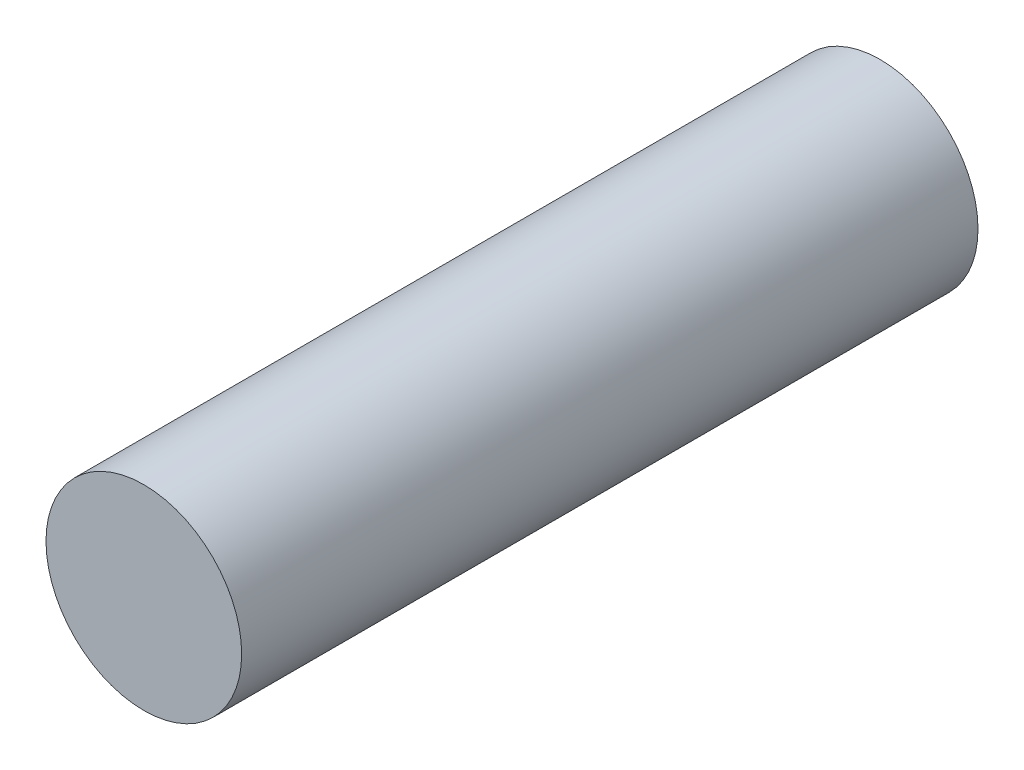
ISO-10303-21;
HEADER;
FILE_DESCRIPTION(('STEP AP214'),'2;1');
FILE_NAME('part.step','',(''),(''),'','','');
FILE_SCHEMA(('AUTOMOTIVE_DESIGN { 1 0 10303 214 1 1 1 1 }'));
ENDSEC;
DATA;
#1=APPLICATION_CONTEXT('core data for automotive mechanical design processes');
#2=APPLICATION_PROTOCOL_DEFINITION('international standard','automotive_design',2000,#1);
#3=PRODUCT_CONTEXT('',#1,'mechanical');
#4=PRODUCT('Part','Part','',(#3));
#5=PRODUCT_RELATED_PRODUCT_CATEGORY('part','',(#4));
#6=PRODUCT_DEFINITION_FORMATION('','',#4);
#7=PRODUCT_DEFINITION_CONTEXT('part definition',#1,'design');
#8=PRODUCT_DEFINITION('design','',#6,#7);
#9=PRODUCT_DEFINITION_SHAPE('','',#8);
#10=(LENGTH_UNIT() NAMED_UNIT(*) SI_UNIT(.MILLI.,.METRE.));
#11=(NAMED_UNIT(*) PLANE_ANGLE_UNIT() SI_UNIT($,.RADIAN.));
#12=(NAMED_UNIT(*) SI_UNIT($,.STERADIAN.) SOLID_ANGLE_UNIT());
#13=UNCERTAINTY_MEASURE_WITH_UNIT(LENGTH_MEASURE(1.E-05),#10,'distance_accuracy_value','');
#14=(GEOMETRIC_REPRESENTATION_CONTEXT(3) GLOBAL_UNCERTAINTY_ASSIGNED_CONTEXT((#13)) GLOBAL_UNIT_ASSIGNED_CONTEXT((#10,
#11,#12)) REPRESENTATION_CONTEXT('',''));
#15=CARTESIAN_POINT('',(0.,0.,0.));
#16=DIRECTION('',(0.,0.,1.));
#17=DIRECTION('',(1.,0.,0.));
#18=AXIS2_PLACEMENT_3D('',#15,#16,#17);
#19=CARTESIAN_POINT('',(0.,0.,35.));
#20=DIRECTION('',(0.,0.,-1.));
#21=DIRECTION('',(-1.,0.,0.));
#22=AXIS2_PLACEMENT_3D('',#19,#20,#21);
#23=CYLINDRICAL_SURFACE('',#22,4.65);
#24=CARTESIAN_POINT('',(0.,0.,35.));
#25=DIRECTION('',(0.,0.,1.));
#26=DIRECTION('',(1.,0.,0.));
#27=AXIS2_PLACEMENT_3D('',#24,#25,#26);
#28=CIRCLE('',#27,4.65);
#29=CARTESIAN_POINT('',(4.65,0.,35.));
#30=VERTEX_POINT('',#29);
#31=EDGE_CURVE('E10',#30,#30,#28,.T.);
#32=ORIENTED_EDGE('',*,*,#31,.F.);
#33=EDGE_LOOP('',(#32));
#34=FACE_BOUND('',#33,.T.);
#35=CARTESIAN_POINT('',(0.,0.,0.));
#36=DIRECTION('',(0.,0.,1.));
#37=DIRECTION('',(1.,0.,0.));
#38=AXIS2_PLACEMENT_3D('',#35,#36,#37);
#39=CIRCLE('',#38,4.65);
#40=CARTESIAN_POINT('',(4.65,0.,0.));
#41=VERTEX_POINT('',#40);
#42=EDGE_CURVE('E37',#41,#41,#39,.T.);
#43=ORIENTED_EDGE('',*,*,#42,.T.);
#44=EDGE_LOOP('',(#43));
#45=FACE_BOUND('',#44,.T.);
#46=ADVANCED_FACE('F34',(#34,#45),#23,.T.);
#47=CARTESIAN_POINT('',(0.,0.,35.));
#48=DIRECTION('',(0.,0.,1.));
#49=DIRECTION('',(1.,0.,0.));
#50=AXIS2_PLACEMENT_3D('',#47,#48,#49);
#51=PLANE('',#50);
#52=ORIENTED_EDGE('',*,*,#31,.T.);
#53=EDGE_LOOP('',(#52));
#54=FACE_BOUND('',#53,.T.);
#55=ADVANCED_FACE('F49',(#54),#51,.T.);
#56=CARTESIAN_POINT('',(0.,0.,0.));
#57=DIRECTION('',(0.,0.,1.));
#58=DIRECTION('',(1.,0.,0.));
#59=AXIS2_PLACEMENT_3D('',#56,#57,#58);
#60=PLANE('',#59);
#61=ORIENTED_EDGE('',*,*,#42,.F.);
#62=EDGE_LOOP('',(#61));
#63=FACE_BOUND('',#62,.T.);
#64=ADVANCED_FACE('F47',(#63),#60,.F.);
#65=CLOSED_SHELL('',(#46,#55,#64));
#66=MANIFOLD_SOLID_BREP('B2',#65);
#67=ADVANCED_BREP_SHAPE_REPRESENTATION('',(#18,#66),#14);
#68=SHAPE_DEFINITION_REPRESENTATION(#9,#67);
ENDSEC;
END-ISO-10303-21;
